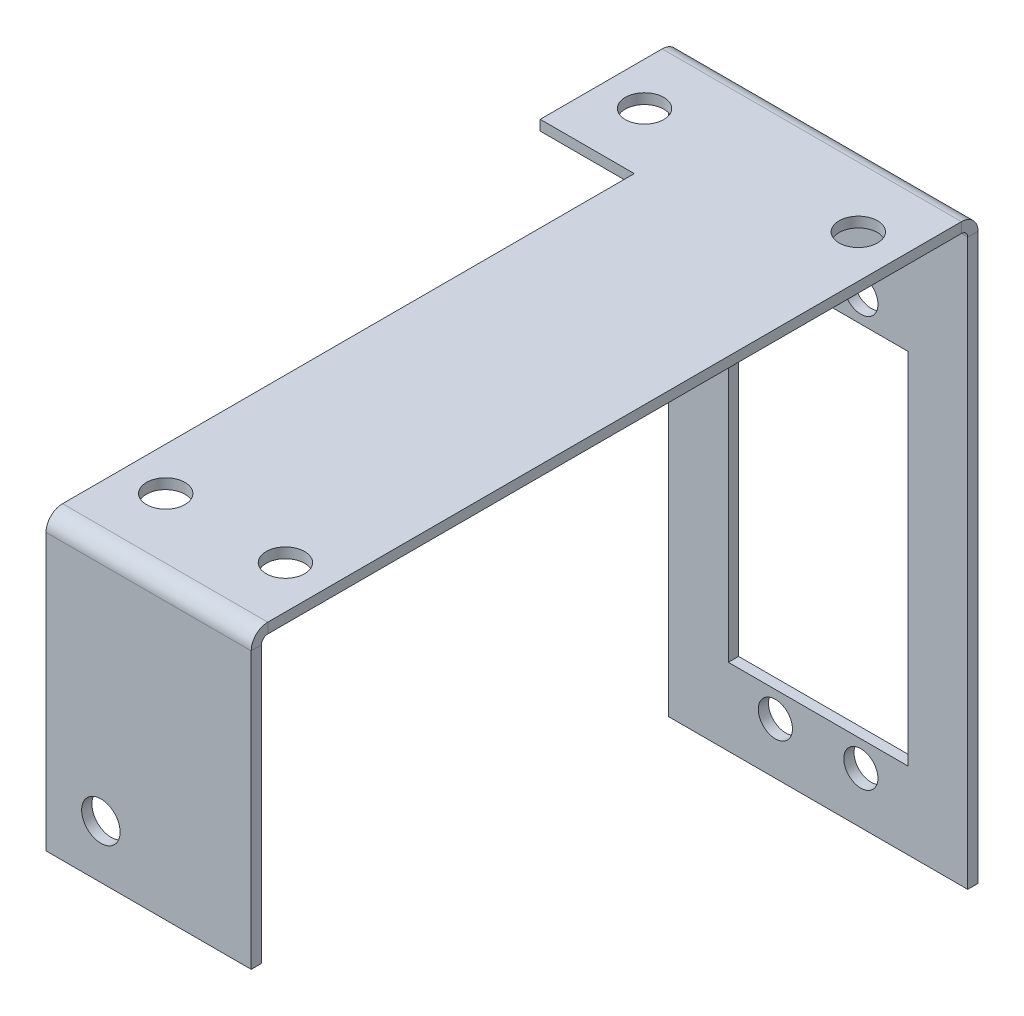
ISO-10303-21;
HEADER;
FILE_DESCRIPTION(('STEP AP214'),'2;1');
FILE_NAME('part.step','',(''),(''),'','','');
FILE_SCHEMA(('AUTOMOTIVE_DESIGN { 1 0 10303 214 1 1 1 1 }'));
ENDSEC;
DATA;
#1=APPLICATION_CONTEXT('core data for automotive mechanical design processes');
#2=APPLICATION_PROTOCOL_DEFINITION('international standard','automotive_design',2000,#1);
#3=PRODUCT_CONTEXT('',#1,'mechanical');
#4=PRODUCT('Part','Part','',(#3));
#5=PRODUCT_RELATED_PRODUCT_CATEGORY('part','',(#4));
#6=PRODUCT_DEFINITION_FORMATION('','',#4);
#7=PRODUCT_DEFINITION_CONTEXT('part definition',#1,'design');
#8=PRODUCT_DEFINITION('design','',#6,#7);
#9=PRODUCT_DEFINITION_SHAPE('','',#8);
#10=(LENGTH_UNIT() NAMED_UNIT(*) SI_UNIT(.MILLI.,.METRE.));
#11=(NAMED_UNIT(*) PLANE_ANGLE_UNIT() SI_UNIT($,.RADIAN.));
#12=(NAMED_UNIT(*) SI_UNIT($,.STERADIAN.) SOLID_ANGLE_UNIT());
#13=UNCERTAINTY_MEASURE_WITH_UNIT(LENGTH_MEASURE(1.E-05),#10,'distance_accuracy_value','');
#14=(GEOMETRIC_REPRESENTATION_CONTEXT(3) GLOBAL_UNCERTAINTY_ASSIGNED_CONTEXT((#13)) GLOBAL_UNIT_ASSIGNED_CONTEXT((#10,
#11,#12)) REPRESENTATION_CONTEXT('',''));
#15=CARTESIAN_POINT('',(0.,0.,0.));
#16=DIRECTION('',(0.,0.,1.));
#17=DIRECTION('',(1.,0.,0.));
#18=AXIS2_PLACEMENT_3D('',#15,#16,#17);
#19=CARTESIAN_POINT('',(28.,59.,0.));
#20=DIRECTION('',(-1.,0.,0.));
#21=DIRECTION('',(0.,-1.,0.));
#22=AXIS2_PLACEMENT_3D('',#19,#20,#21);
#23=PLANE('',#22);
#24=DIRECTION('',(0.,1.,0.));
#25=VECTOR('',#24,1.);
#26=CARTESIAN_POINT('',(28.,57.8000000000003,81.8634));
#27=LINE('',#26,#25);
#28=CARTESIAN_POINT('',(28.,57.8000000000003,81.8634));
#29=VERTEX_POINT('',#28);
#30=CARTESIAN_POINT('',(28.,59.0000000000003,81.8634));
#31=VERTEX_POINT('',#30);
#32=EDGE_CURVE('E111',#29,#31,#27,.T.);
#33=ORIENTED_EDGE('',*,*,#32,.F.);
#34=DIRECTION('',(0.,0.,1.));
#35=VECTOR('',#34,1.);
#36=CARTESIAN_POINT('',(28.,57.8,0.));
#37=LINE('',#36,#35);
#38=CARTESIAN_POINT('',(28.,57.8,0.736599999999997));
#39=VERTEX_POINT('',#38);
#40=EDGE_CURVE('E302',#29,#39,#37,.F.);
#41=ORIENTED_EDGE('',*,*,#40,.T.);
#42=DIRECTION('',(0.,-1.,0.));
#43=VECTOR('',#42,1.);
#44=CARTESIAN_POINT('',(28.,59.,0.736599999999993));
#45=LINE('',#44,#43);
#46=CARTESIAN_POINT('',(28.,59.,0.736599999999993));
#47=VERTEX_POINT('',#46);
#48=EDGE_CURVE('E278',#39,#47,#45,.F.);
#49=ORIENTED_EDGE('',*,*,#48,.T.);
#50=DIRECTION('',(0.,0.,-1.));
#51=VECTOR('',#50,1.);
#52=CARTESIAN_POINT('',(28.,59.,-2.09375685648164E-13));
#53=LINE('',#52,#51);
#54=EDGE_CURVE('E294',#31,#47,#53,.T.);
#55=ORIENTED_EDGE('',*,*,#54,.F.);
#56=EDGE_LOOP('',(#33,#41,#49,#55));
#57=FACE_BOUND('',#56,.T.);
#58=ADVANCED_FACE('F89',(#57),#23,.F.);
#59=CARTESIAN_POINT('',(0.,59.,-2.09375685648164E-13));
#60=DIRECTION('',(0.,-1.,0.));
#61=DIRECTION('',(0.,0.,-1.));
#62=AXIS2_PLACEMENT_3D('',#59,#60,#61);
#63=PLANE('',#62);
#64=CARTESIAN_POINT('',(-2.00000000000001,59.,7.79999999999998));
#65=DIRECTION('',(0.,1.,0.));
#66=DIRECTION('',(0.,0.,1.));
#67=AXIS2_PLACEMENT_3D('',#64,#65,#66);
#68=CIRCLE('',#67,2.25);
#69=CARTESIAN_POINT('',(-2.00000000000001,59.,10.05));
#70=VERTEX_POINT('',#69);
#71=EDGE_CURVE('E855',#70,#70,#68,.T.);
#72=ORIENTED_EDGE('',*,*,#71,.F.);
#73=EDGE_LOOP('',(#72));
#74=FACE_BOUND('',#73,.T.);
#75=CARTESIAN_POINT('',(8.99999999999999,59.0000000000003,74.8));
#76=DIRECTION('',(0.,1.,0.));
#77=DIRECTION('',(0.,0.,1.));
#78=AXIS2_PLACEMENT_3D('',#75,#76,#77);
#79=CIRCLE('',#78,2.25);
#80=CARTESIAN_POINT('',(8.99999999999999,59.0000000000003,77.05));
#81=VERTEX_POINT('',#80);
#82=EDGE_CURVE('E861',#81,#81,#79,.T.);
#83=ORIENTED_EDGE('',*,*,#82,.F.);
#84=EDGE_LOOP('',(#83));
#85=FACE_BOUND('',#84,.T.);
#86=CARTESIAN_POINT('',(23.,59.0000000000003,74.8));
#87=DIRECTION('',(0.,1.,0.));
#88=DIRECTION('',(0.,0.,1.));
#89=AXIS2_PLACEMENT_3D('',#86,#87,#88);
#90=CIRCLE('',#89,2.25);
#91=CARTESIAN_POINT('',(23.,59.0000000000003,77.05));
#92=VERTEX_POINT('',#91);
#93=EDGE_CURVE('E869',#92,#92,#90,.T.);
#94=ORIENTED_EDGE('',*,*,#93,.F.);
#95=EDGE_LOOP('',(#94));
#96=FACE_BOUND('',#95,.T.);
#97=CARTESIAN_POINT('',(23.,59.,7.79999999999998));
#98=DIRECTION('',(0.,1.,0.));
#99=DIRECTION('',(0.,0.,1.));
#100=AXIS2_PLACEMENT_3D('',#97,#98,#99);
#101=CIRCLE('',#100,2.25);
#102=CARTESIAN_POINT('',(23.,59.,10.05));
#103=VERTEX_POINT('',#102);
#104=EDGE_CURVE('E859',#103,#103,#101,.T.);
#105=ORIENTED_EDGE('',*,*,#104,.F.);
#106=EDGE_LOOP('',(#105));
#107=FACE_BOUND('',#106,.T.);
#108=DIRECTION('',(-1.,0.,0.));
#109=VECTOR('',#108,1.);
#110=CARTESIAN_POINT('',(3.99999999999999,59.0000000000003,81.8634));
#111=LINE('',#110,#109);
#112=CARTESIAN_POINT('',(3.99999999999999,59.0000000000003,81.8634));
#113=VERTEX_POINT('',#112);
#114=EDGE_CURVE('E104',#113,#31,#111,.F.);
#115=ORIENTED_EDGE('',*,*,#114,.T.);
#116=ORIENTED_EDGE('',*,*,#54,.T.);
#117=DIRECTION('',(-1.,0.,0.));
#118=VECTOR('',#117,1.);
#119=CARTESIAN_POINT('',(28.,59.,0.736599999999993));
#120=LINE('',#119,#118);
#121=CARTESIAN_POINT('',(-7.00000000000001,59.,0.736599999999993));
#122=VERTEX_POINT('',#121);
#123=EDGE_CURVE('E304',#122,#47,#120,.F.);
#124=ORIENTED_EDGE('',*,*,#123,.F.);
#125=DIRECTION('',(0.,0.,1.));
#126=VECTOR('',#125,1.);
#127=CARTESIAN_POINT('',(-7.00000000000001,59.,-2.08566148026042E-13));
#128=LINE('',#127,#126);
#129=CARTESIAN_POINT('',(-7.00000000000001,59.,15.));
#130=VERTEX_POINT('',#129);
#131=EDGE_CURVE('E292',#122,#130,#128,.T.);
#132=ORIENTED_EDGE('',*,*,#131,.T.);
#133=DIRECTION('',(1.,0.,0.));
#134=VECTOR('',#133,1.);
#135=CARTESIAN_POINT('',(0.,59.,15.));
#136=LINE('',#135,#134);
#137=CARTESIAN_POINT('',(3.99999999999999,59.,15.));
#138=VERTEX_POINT('',#137);
#139=EDGE_CURVE('E290',#130,#138,#136,.T.);
#140=ORIENTED_EDGE('',*,*,#139,.T.);
#141=DIRECTION('',(0.,0.,1.));
#142=VECTOR('',#141,1.);
#143=CARTESIAN_POINT('',(3.99999999999999,59.,-2.09325257640142E-13));
#144=LINE('',#143,#142);
#145=EDGE_CURVE('E288',#138,#113,#144,.T.);
#146=ORIENTED_EDGE('',*,*,#145,.T.);
#147=EDGE_LOOP('',(#115,#116,#124,#132,#140,#146));
#148=FACE_BOUND('',#147,.T.);
#149=ADVANCED_FACE('F450',(#74,#85,#96,#107,#148),#63,.F.);
#150=CARTESIAN_POINT('',(0.,57.8,-2.05185908041553E-13));
#151=DIRECTION('',(0.,-1.,0.));
#152=DIRECTION('',(0.,0.,-1.));
#153=AXIS2_PLACEMENT_3D('',#150,#151,#152);
#154=PLANE('',#153);
#155=CARTESIAN_POINT('',(-2.00000000000001,57.8,7.79999999999999));
#156=DIRECTION('',(0.,-1.,0.));
#157=DIRECTION('',(0.,0.,-1.));
#158=AXIS2_PLACEMENT_3D('',#155,#156,#157);
#159=CIRCLE('',#158,2.25);
#160=CARTESIAN_POINT('',(-2.00000000000001,57.8,5.54999999999999));
#161=VERTEX_POINT('',#160);
#162=EDGE_CURVE('E852',#161,#161,#159,.F.);
#163=ORIENTED_EDGE('',*,*,#162,.T.);
#164=EDGE_LOOP('',(#163));
#165=FACE_BOUND('',#164,.T.);
#166=CARTESIAN_POINT('',(8.99999999999999,57.8000000000003,74.8));
#167=DIRECTION('',(0.,-1.,0.));
#168=DIRECTION('',(0.,0.,-1.));
#169=AXIS2_PLACEMENT_3D('',#166,#167,#168);
#170=CIRCLE('',#169,2.25);
#171=CARTESIAN_POINT('',(8.99999999999999,57.8000000000003,72.55));
#172=VERTEX_POINT('',#171);
#173=EDGE_CURVE('E866',#172,#172,#170,.F.);
#174=ORIENTED_EDGE('',*,*,#173,.T.);
#175=EDGE_LOOP('',(#174));
#176=FACE_BOUND('',#175,.T.);
#177=CARTESIAN_POINT('',(23.,57.8000000000003,74.8));
#178=DIRECTION('',(0.,-1.,0.));
#179=DIRECTION('',(0.,0.,-1.));
#180=AXIS2_PLACEMENT_3D('',#177,#178,#179);
#181=CIRCLE('',#180,2.25);
#182=CARTESIAN_POINT('',(23.,57.8000000000003,72.55));
#183=VERTEX_POINT('',#182);
#184=EDGE_CURVE('E872',#183,#183,#181,.F.);
#185=ORIENTED_EDGE('',*,*,#184,.T.);
#186=EDGE_LOOP('',(#185));
#187=FACE_BOUND('',#186,.T.);
#188=CARTESIAN_POINT('',(23.,57.8,7.79999999999999));
#189=DIRECTION('',(0.,-1.,0.));
#190=DIRECTION('',(0.,0.,-1.));
#191=AXIS2_PLACEMENT_3D('',#188,#189,#190);
#192=CIRCLE('',#191,2.25);
#193=CARTESIAN_POINT('',(23.,57.8,5.54999999999999));
#194=VERTEX_POINT('',#193);
#195=EDGE_CURVE('E856',#194,#194,#192,.F.);
#196=ORIENTED_EDGE('',*,*,#195,.T.);
#197=EDGE_LOOP('',(#196));
#198=FACE_BOUND('',#197,.T.);
#199=ORIENTED_EDGE('',*,*,#40,.F.);
#200=DIRECTION('',(-1.,0.,0.));
#201=VECTOR('',#200,1.);
#202=CARTESIAN_POINT('',(3.99999999999999,57.8000000000003,81.8634));
#203=LINE('',#202,#201);
#204=CARTESIAN_POINT('',(3.99999999999999,57.8000000000003,81.8634));
#205=VERTEX_POINT('',#204);
#206=EDGE_CURVE('E273',#205,#29,#203,.F.);
#207=ORIENTED_EDGE('',*,*,#206,.F.);
#208=DIRECTION('',(0.,0.,-1.));
#209=VECTOR('',#208,1.);
#210=CARTESIAN_POINT('',(3.99999999999999,57.8,15.));
#211=LINE('',#210,#209);
#212=CARTESIAN_POINT('',(3.99999999999999,57.8,15.));
#213=VERTEX_POINT('',#212);
#214=EDGE_CURVE('E296',#213,#205,#211,.F.);
#215=ORIENTED_EDGE('',*,*,#214,.F.);
#216=DIRECTION('',(-1.,0.,0.));
#217=VECTOR('',#216,1.);
#218=CARTESIAN_POINT('',(-7.00000000000001,57.8,15.));
#219=LINE('',#218,#217);
#220=CARTESIAN_POINT('',(-7.00000000000001,57.8,15.));
#221=VERTEX_POINT('',#220);
#222=EDGE_CURVE('E298',#221,#213,#219,.F.);
#223=ORIENTED_EDGE('',*,*,#222,.F.);
#224=DIRECTION('',(0.,0.,-1.));
#225=VECTOR('',#224,1.);
#226=CARTESIAN_POINT('',(-7.00000000000001,57.8,15.));
#227=LINE('',#226,#225);
#228=CARTESIAN_POINT('',(-7.00000000000001,57.8,0.736599999999997));
#229=VERTEX_POINT('',#228);
#230=EDGE_CURVE('E300',#229,#221,#227,.F.);
#231=ORIENTED_EDGE('',*,*,#230,.F.);
#232=DIRECTION('',(-1.,0.,0.));
#233=VECTOR('',#232,1.);
#234=CARTESIAN_POINT('',(28.,57.8,0.736599999999997));
#235=LINE('',#234,#233);
#236=EDGE_CURVE('E310',#39,#229,#235,.T.);
#237=ORIENTED_EDGE('',*,*,#236,.F.);
#238=EDGE_LOOP('',(#199,#207,#215,#223,#231,#237));
#239=FACE_BOUND('',#238,.T.);
#240=ADVANCED_FACE('F445',(#165,#176,#187,#198,#239),#154,.T.);
#241=CARTESIAN_POINT('',(3.99999999999999,59.,15.));
#242=DIRECTION('',(1.,0.,0.));
#243=DIRECTION('',(0.,1.,0.));
#244=AXIS2_PLACEMENT_3D('',#241,#242,#243);
#245=PLANE('',#244);
#246=DIRECTION('',(0.,1.,0.));
#247=VECTOR('',#246,1.);
#248=CARTESIAN_POINT('',(3.99999999999999,57.8000000000003,81.8634));
#249=LINE('',#248,#247);
#250=EDGE_CURVE('E269',#205,#113,#249,.T.);
#251=ORIENTED_EDGE('',*,*,#250,.T.);
#252=ORIENTED_EDGE('',*,*,#145,.F.);
#253=DIRECTION('',(0.,1.,0.));
#254=VECTOR('',#253,1.);
#255=CARTESIAN_POINT('',(3.99999999999999,59.,15.));
#256=LINE('',#255,#254);
#257=EDGE_CURVE('E285',#138,#213,#256,.F.);
#258=ORIENTED_EDGE('',*,*,#257,.T.);
#259=ORIENTED_EDGE('',*,*,#214,.T.);
#260=EDGE_LOOP('',(#251,#252,#258,#259));
#261=FACE_BOUND('',#260,.T.);
#262=ADVANCED_FACE('F438',(#261),#245,.F.);
#263=CARTESIAN_POINT('',(-7.00000000000001,59.,-1.2));
#264=DIRECTION('',(-1.,0.,0.));
#265=DIRECTION('',(0.,-1.,0.));
#266=AXIS2_PLACEMENT_3D('',#263,#264,#265);
#267=PLANE('',#266);
#268=DIRECTION('',(0.,-1.,0.));
#269=VECTOR('',#268,1.);
#270=CARTESIAN_POINT('',(-7.00000000000001,59.,0.));
#271=LINE('',#270,#269);
#272=CARTESIAN_POINT('',(-7.00000000000001,57.0634,0.));
#273=VERTEX_POINT('',#272);
#274=CARTESIAN_POINT('',(-7.,-9.,0.));
#275=VERTEX_POINT('',#274);
#276=EDGE_CURVE('E404',#273,#275,#271,.T.);
#277=ORIENTED_EDGE('',*,*,#276,.F.);
#278=DIRECTION('',(0.,0.,-1.));
#279=VECTOR('',#278,1.);
#280=CARTESIAN_POINT('',(-7.00000000000001,57.0634,0.));
#281=LINE('',#280,#279);
#282=CARTESIAN_POINT('',(-7.00000000000001,57.0634,-1.2));
#283=VERTEX_POINT('',#282);
#284=EDGE_CURVE('E321',#273,#283,#281,.T.);
#285=ORIENTED_EDGE('',*,*,#284,.T.);
#286=DIRECTION('',(0.,-1.,0.));
#287=VECTOR('',#286,1.);
#288=CARTESIAN_POINT('',(-7.00000000000001,59.,-1.2));
#289=LINE('',#288,#287);
#290=CARTESIAN_POINT('',(-7.,-9.,-1.2));
#291=VERTEX_POINT('',#290);
#292=EDGE_CURVE('E396',#283,#291,#289,.T.);
#293=ORIENTED_EDGE('',*,*,#292,.T.);
#294=DIRECTION('',(0.,0.,1.));
#295=VECTOR('',#294,1.);
#296=CARTESIAN_POINT('',(-7.,-9.,-1.2));
#297=LINE('',#296,#295);
#298=EDGE_CURVE('E93',#291,#275,#297,.T.);
#299=ORIENTED_EDGE('',*,*,#298,.T.);
#300=EDGE_LOOP('',(#277,#285,#293,#299));
#301=FACE_BOUND('',#300,.T.);
#302=ADVANCED_FACE('F436',(#301),#267,.T.);
#303=CARTESIAN_POINT('',(0.,0.,-1.2));
#304=DIRECTION('',(0.,0.,-1.));
#305=DIRECTION('',(-1.,0.,0.));
#306=AXIS2_PLACEMENT_3D('',#303,#304,#305);
#307=PLANE('',#306);
#308=CARTESIAN_POINT('',(15.5,-3.,-1.2));
#309=DIRECTION('',(0.,0.,1.));
#310=DIRECTION('',(1.,0.,0.));
#311=AXIS2_PLACEMENT_3D('',#308,#309,#310);
#312=CIRCLE('',#311,2.);
#313=CARTESIAN_POINT('',(17.5,-3.,-1.2));
#314=VERTEX_POINT('',#313);
#315=EDGE_CURVE('E337',#314,#314,#312,.T.);
#316=ORIENTED_EDGE('',*,*,#315,.T.);
#317=EDGE_LOOP('',(#316));
#318=FACE_BOUND('',#317,.T.);
#319=CARTESIAN_POINT('',(5.49999999999999,45.,-1.2));
#320=DIRECTION('',(0.,0.,1.));
#321=DIRECTION('',(1.,0.,0.));
#322=AXIS2_PLACEMENT_3D('',#319,#320,#321);
#323=CIRCLE('',#322,2.);
#324=CARTESIAN_POINT('',(7.5,45.,-1.2));
#325=VERTEX_POINT('',#324);
#326=EDGE_CURVE('E343',#325,#325,#323,.T.);
#327=ORIENTED_EDGE('',*,*,#326,.T.);
#328=EDGE_LOOP('',(#327));
#329=FACE_BOUND('',#328,.T.);
#330=CARTESIAN_POINT('',(5.5,-3.,-1.2));
#331=DIRECTION('',(0.,0.,1.));
#332=DIRECTION('',(1.,0.,0.));
#333=AXIS2_PLACEMENT_3D('',#330,#331,#332);
#334=CIRCLE('',#333,2.);
#335=CARTESIAN_POINT('',(7.5,-3.,-1.2));
#336=VERTEX_POINT('',#335);
#337=EDGE_CURVE('E349',#336,#336,#334,.T.);
#338=ORIENTED_EDGE('',*,*,#337,.T.);
#339=EDGE_LOOP('',(#338));
#340=FACE_BOUND('',#339,.T.);
#341=CARTESIAN_POINT('',(15.5,45.,-1.2));
#342=DIRECTION('',(0.,0.,1.));
#343=DIRECTION('',(1.,0.,0.));
#344=AXIS2_PLACEMENT_3D('',#341,#342,#343);
#345=CIRCLE('',#344,2.);
#346=CARTESIAN_POINT('',(17.5,45.,-1.2));
#347=VERTEX_POINT('',#346);
#348=EDGE_CURVE('E355',#347,#347,#345,.T.);
#349=ORIENTED_EDGE('',*,*,#348,.T.);
#350=EDGE_LOOP('',(#349));
#351=FACE_BOUND('',#350,.T.);
#352=DIRECTION('',(0.,-1.,0.));
#353=VECTOR('',#352,1.);
#354=CARTESIAN_POINT('',(0.,0.,-1.2));
#355=LINE('',#354,#353);
#356=CARTESIAN_POINT('',(0.,42.,-1.2));
#357=VERTEX_POINT('',#356);
#358=CARTESIAN_POINT('',(0.,0.,-1.2));
#359=VERTEX_POINT('',#358);
#360=EDGE_CURVE('E361',#357,#359,#355,.T.);
#361=ORIENTED_EDGE('',*,*,#360,.T.);
#362=DIRECTION('',(1.,0.,0.));
#363=VECTOR('',#362,1.);
#364=CARTESIAN_POINT('',(0.,0.,-1.2));
#365=LINE('',#364,#363);
#366=CARTESIAN_POINT('',(21.,0.,-1.2));
#367=VERTEX_POINT('',#366);
#368=EDGE_CURVE('E364',#359,#367,#365,.T.);
#369=ORIENTED_EDGE('',*,*,#368,.T.);
#370=DIRECTION('',(0.,1.,0.));
#371=VECTOR('',#370,1.);
#372=CARTESIAN_POINT('',(21.,0.,-1.2));
#373=LINE('',#372,#371);
#374=CARTESIAN_POINT('',(21.,42.,-1.2));
#375=VERTEX_POINT('',#374);
#376=EDGE_CURVE('E368',#367,#375,#373,.T.);
#377=ORIENTED_EDGE('',*,*,#376,.T.);
#378=DIRECTION('',(-1.,0.,0.));
#379=VECTOR('',#378,1.);
#380=CARTESIAN_POINT('',(0.,42.,-1.2));
#381=LINE('',#380,#379);
#382=EDGE_CURVE('E371',#375,#357,#381,.T.);
#383=ORIENTED_EDGE('',*,*,#382,.T.);
#384=EDGE_LOOP('',(#361,#369,#377,#383));
#385=FACE_BOUND('',#384,.T.);
#386=ORIENTED_EDGE('',*,*,#292,.F.);
#387=DIRECTION('',(-1.,0.,0.));
#388=VECTOR('',#387,1.);
#389=CARTESIAN_POINT('',(-7.00000000000001,57.0634,-1.2));
#390=LINE('',#389,#388);
#391=CARTESIAN_POINT('',(28.,57.0634,-1.2));
#392=VERTEX_POINT('',#391);
#393=EDGE_CURVE('E314',#283,#392,#390,.F.);
#394=ORIENTED_EDGE('',*,*,#393,.T.);
#395=DIRECTION('',(0.,1.,0.));
#396=VECTOR('',#395,1.);
#397=CARTESIAN_POINT('',(28.,59.,-1.2));
#398=LINE('',#397,#396);
#399=CARTESIAN_POINT('',(28.,-9.,-1.2));
#400=VERTEX_POINT('',#399);
#401=EDGE_CURVE('E393',#400,#392,#398,.T.);
#402=ORIENTED_EDGE('',*,*,#401,.F.);
#403=DIRECTION('',(1.,0.,0.));
#404=VECTOR('',#403,1.);
#405=CARTESIAN_POINT('',(28.,-9.,-1.2));
#406=LINE('',#405,#404);
#407=EDGE_CURVE('E399',#291,#400,#406,.T.);
#408=ORIENTED_EDGE('',*,*,#407,.F.);
#409=EDGE_LOOP('',(#386,#394,#402,#408));
#410=FACE_BOUND('',#409,.T.);
#411=ADVANCED_FACE('F427',(#318,#329,#340,#351,#385,#410),#307,.T.);
#412=CARTESIAN_POINT('',(0.,0.,0.));
#413=DIRECTION('',(0.,0.,-1.));
#414=DIRECTION('',(-1.,0.,0.));
#415=AXIS2_PLACEMENT_3D('',#412,#413,#414);
#416=PLANE('',#415);
#417=DIRECTION('',(1.,0.,0.));
#418=VECTOR('',#417,1.);
#419=CARTESIAN_POINT('',(0.,0.,0.));
#420=LINE('',#419,#418);
#421=CARTESIAN_POINT('',(0.,0.,0.));
#422=VERTEX_POINT('',#421);
#423=CARTESIAN_POINT('',(21.,0.,0.));
#424=VERTEX_POINT('',#423);
#425=EDGE_CURVE('E376',#422,#424,#420,.T.);
#426=ORIENTED_EDGE('',*,*,#425,.F.);
#427=DIRECTION('',(0.,-1.,0.));
#428=VECTOR('',#427,1.);
#429=CARTESIAN_POINT('',(0.,0.,0.));
#430=LINE('',#429,#428);
#431=CARTESIAN_POINT('',(0.,42.,0.));
#432=VERTEX_POINT('',#431);
#433=EDGE_CURVE('E358',#432,#422,#430,.T.);
#434=ORIENTED_EDGE('',*,*,#433,.F.);
#435=DIRECTION('',(-1.,0.,0.));
#436=VECTOR('',#435,1.);
#437=CARTESIAN_POINT('',(0.,42.,0.));
#438=LINE('',#437,#436);
#439=CARTESIAN_POINT('',(21.,42.,0.));
#440=VERTEX_POINT('',#439);
#441=EDGE_CURVE('E365',#440,#432,#438,.T.);
#442=ORIENTED_EDGE('',*,*,#441,.F.);
#443=DIRECTION('',(0.,1.,0.));
#444=VECTOR('',#443,1.);
#445=CARTESIAN_POINT('',(21.,0.,0.));
#446=LINE('',#445,#444);
#447=EDGE_CURVE('E379',#424,#440,#446,.T.);
#448=ORIENTED_EDGE('',*,*,#447,.F.);
#449=EDGE_LOOP('',(#426,#434,#442,#448));
#450=FACE_BOUND('',#449,.T.);
#451=CARTESIAN_POINT('',(15.5,45.,0.));
#452=DIRECTION('',(0.,0.,1.));
#453=DIRECTION('',(1.,0.,0.));
#454=AXIS2_PLACEMENT_3D('',#451,#452,#453);
#455=CIRCLE('',#454,2.);
#456=CARTESIAN_POINT('',(17.5,45.,0.));
#457=VERTEX_POINT('',#456);
#458=EDGE_CURVE('E352',#457,#457,#455,.T.);
#459=ORIENTED_EDGE('',*,*,#458,.F.);
#460=EDGE_LOOP('',(#459));
#461=FACE_BOUND('',#460,.T.);
#462=CARTESIAN_POINT('',(5.5,-3.,0.));
#463=DIRECTION('',(0.,0.,1.));
#464=DIRECTION('',(1.,0.,0.));
#465=AXIS2_PLACEMENT_3D('',#462,#463,#464);
#466=CIRCLE('',#465,2.);
#467=CARTESIAN_POINT('',(7.5,-3.,0.));
#468=VERTEX_POINT('',#467);
#469=EDGE_CURVE('E346',#468,#468,#466,.T.);
#470=ORIENTED_EDGE('',*,*,#469,.F.);
#471=EDGE_LOOP('',(#470));
#472=FACE_BOUND('',#471,.T.);
#473=CARTESIAN_POINT('',(5.49999999999999,45.,0.));
#474=DIRECTION('',(0.,0.,1.));
#475=DIRECTION('',(1.,0.,0.));
#476=AXIS2_PLACEMENT_3D('',#473,#474,#475);
#477=CIRCLE('',#476,2.);
#478=CARTESIAN_POINT('',(7.5,45.,0.));
#479=VERTEX_POINT('',#478);
#480=EDGE_CURVE('E340',#479,#479,#477,.T.);
#481=ORIENTED_EDGE('',*,*,#480,.F.);
#482=EDGE_LOOP('',(#481));
#483=FACE_BOUND('',#482,.T.);
#484=CARTESIAN_POINT('',(15.5,-3.,0.));
#485=DIRECTION('',(0.,0.,1.));
#486=DIRECTION('',(1.,0.,0.));
#487=AXIS2_PLACEMENT_3D('',#484,#485,#486);
#488=CIRCLE('',#487,2.);
#489=CARTESIAN_POINT('',(17.5,-3.,0.));
#490=VERTEX_POINT('',#489);
#491=EDGE_CURVE('E334',#490,#490,#488,.T.);
#492=ORIENTED_EDGE('',*,*,#491,.F.);
#493=EDGE_LOOP('',(#492));
#494=FACE_BOUND('',#493,.T.);
#495=DIRECTION('',(-1.,0.,0.));
#496=VECTOR('',#495,1.);
#497=CARTESIAN_POINT('',(-7.00000000000001,57.0634,0.));
#498=LINE('',#497,#496);
#499=CARTESIAN_POINT('',(28.,57.0634,0.));
#500=VERTEX_POINT('',#499);
#501=EDGE_CURVE('E327',#273,#500,#498,.F.);
#502=ORIENTED_EDGE('',*,*,#501,.F.);
#503=ORIENTED_EDGE('',*,*,#276,.T.);
#504=DIRECTION('',(1.,0.,0.));
#505=VECTOR('',#504,1.);
#506=CARTESIAN_POINT('',(28.,-9.,0.));
#507=LINE('',#506,#505);
#508=CARTESIAN_POINT('',(28.,-9.,0.));
#509=VERTEX_POINT('',#508);
#510=EDGE_CURVE('E397',#275,#509,#507,.T.);
#511=ORIENTED_EDGE('',*,*,#510,.T.);
#512=DIRECTION('',(0.,1.,0.));
#513=VECTOR('',#512,1.);
#514=CARTESIAN_POINT('',(28.,59.,0.));
#515=LINE('',#514,#513);
#516=EDGE_CURVE('E386',#509,#500,#515,.T.);
#517=ORIENTED_EDGE('',*,*,#516,.T.);
#518=EDGE_LOOP('',(#502,#503,#511,#517));
#519=FACE_BOUND('',#518,.T.);
#520=ADVANCED_FACE('F410',(#450,#461,#472,#483,#494,#519),#416,.F.);
#521=CARTESIAN_POINT('',(28.,59.,-1.2));
#522=DIRECTION('',(1.,0.,0.));
#523=DIRECTION('',(0.,1.,0.));
#524=AXIS2_PLACEMENT_3D('',#521,#522,#523);
#525=PLANE('',#524);
#526=DIRECTION('',(0.,0.,-1.));
#527=VECTOR('',#526,1.);
#528=CARTESIAN_POINT('',(28.,57.0634,0.));
#529=LINE('',#528,#527);
#530=EDGE_CURVE('E331',#500,#392,#529,.T.);
#531=ORIENTED_EDGE('',*,*,#530,.F.);
#532=ORIENTED_EDGE('',*,*,#516,.F.);
#533=DIRECTION('',(0.,0.,1.));
#534=VECTOR('',#533,1.);
#535=CARTESIAN_POINT('',(28.,-9.,-1.2));
#536=LINE('',#535,#534);
#537=EDGE_CURVE('E13',#400,#509,#536,.T.);
#538=ORIENTED_EDGE('',*,*,#537,.F.);
#539=ORIENTED_EDGE('',*,*,#401,.T.);
#540=EDGE_LOOP('',(#531,#532,#538,#539));
#541=FACE_BOUND('',#540,.T.);
#542=ADVANCED_FACE('F91',(#541),#525,.T.);
#543=CARTESIAN_POINT('',(28.,-9.,-1.2));
#544=DIRECTION('',(0.,-1.,0.));
#545=DIRECTION('',(1.,0.,0.));
#546=AXIS2_PLACEMENT_3D('',#543,#544,#545);
#547=PLANE('',#546);
#548=ORIENTED_EDGE('',*,*,#510,.F.);
#549=ORIENTED_EDGE('',*,*,#298,.F.);
#550=ORIENTED_EDGE('',*,*,#407,.T.);
#551=ORIENTED_EDGE('',*,*,#537,.T.);
#552=EDGE_LOOP('',(#548,#549,#550,#551));
#553=FACE_BOUND('',#552,.T.);
#554=ADVANCED_FACE('F417',(#553),#547,.T.);
#555=CARTESIAN_POINT('',(0.,0.,-1.2));
#556=DIRECTION('',(-1.,0.,0.));
#557=DIRECTION('',(0.,0.,1.));
#558=AXIS2_PLACEMENT_3D('',#555,#556,#557);
#559=PLANE('',#558);
#560=ORIENTED_EDGE('',*,*,#433,.T.);
#561=DIRECTION('',(0.,0.,1.));
#562=VECTOR('',#561,1.);
#563=CARTESIAN_POINT('',(0.,0.,-1.2));
#564=LINE('',#563,#562);
#565=EDGE_CURVE('E374',#359,#422,#564,.T.);
#566=ORIENTED_EDGE('',*,*,#565,.F.);
#567=ORIENTED_EDGE('',*,*,#360,.F.);
#568=DIRECTION('',(0.,0.,1.));
#569=VECTOR('',#568,1.);
#570=CARTESIAN_POINT('',(0.,42.,-1.2));
#571=LINE('',#570,#569);
#572=EDGE_CURVE('E384',#357,#432,#571,.T.);
#573=ORIENTED_EDGE('',*,*,#572,.T.);
#574=EDGE_LOOP('',(#560,#566,#567,#573));
#575=FACE_BOUND('',#574,.T.);
#576=ADVANCED_FACE('F492',(#575),#559,.F.);
#577=CARTESIAN_POINT('',(0.,42.,-1.2));
#578=DIRECTION('',(0.,1.,0.));
#579=DIRECTION('',(0.,0.,1.));
#580=AXIS2_PLACEMENT_3D('',#577,#578,#579);
#581=PLANE('',#580);
#582=ORIENTED_EDGE('',*,*,#441,.T.);
#583=ORIENTED_EDGE('',*,*,#572,.F.);
#584=ORIENTED_EDGE('',*,*,#382,.F.);
#585=DIRECTION('',(0.,0.,1.));
#586=VECTOR('',#585,1.);
#587=CARTESIAN_POINT('',(21.,42.,-1.2));
#588=LINE('',#587,#586);
#589=EDGE_CURVE('E387',#375,#440,#588,.T.);
#590=ORIENTED_EDGE('',*,*,#589,.T.);
#591=EDGE_LOOP('',(#582,#583,#584,#590));
#592=FACE_BOUND('',#591,.T.);
#593=ADVANCED_FACE('F488',(#592),#581,.F.);
#594=CARTESIAN_POINT('',(21.,0.,-1.2));
#595=DIRECTION('',(1.,0.,0.));
#596=DIRECTION('',(0.,0.,-1.));
#597=AXIS2_PLACEMENT_3D('',#594,#595,#596);
#598=PLANE('',#597);
#599=ORIENTED_EDGE('',*,*,#447,.T.);
#600=ORIENTED_EDGE('',*,*,#589,.F.);
#601=ORIENTED_EDGE('',*,*,#376,.F.);
#602=DIRECTION('',(0.,0.,1.));
#603=VECTOR('',#602,1.);
#604=CARTESIAN_POINT('',(21.,0.,-1.2));
#605=LINE('',#604,#603);
#606=EDGE_CURVE('E389',#367,#424,#605,.T.);
#607=ORIENTED_EDGE('',*,*,#606,.T.);
#608=EDGE_LOOP('',(#599,#600,#601,#607));
#609=FACE_BOUND('',#608,.T.);
#610=ADVANCED_FACE('F491',(#609),#598,.F.);
#611=CARTESIAN_POINT('',(0.,0.,-1.2));
#612=DIRECTION('',(0.,-1.,0.));
#613=DIRECTION('',(0.,0.,-1.));
#614=AXIS2_PLACEMENT_3D('',#611,#612,#613);
#615=PLANE('',#614);
#616=ORIENTED_EDGE('',*,*,#425,.T.);
#617=ORIENTED_EDGE('',*,*,#606,.F.);
#618=ORIENTED_EDGE('',*,*,#368,.F.);
#619=ORIENTED_EDGE('',*,*,#565,.T.);
#620=EDGE_LOOP('',(#616,#617,#618,#619));
#621=FACE_BOUND('',#620,.T.);
#622=ADVANCED_FACE('F486',(#621),#615,.F.);
#623=CARTESIAN_POINT('',(15.5,45.,-1.2));
#624=DIRECTION('',(0.,0.,1.));
#625=DIRECTION('',(1.,0.,0.));
#626=AXIS2_PLACEMENT_3D('',#623,#624,#625);
#627=CYLINDRICAL_SURFACE('',#626,2.);
#628=ORIENTED_EDGE('',*,*,#348,.F.);
#629=EDGE_LOOP('',(#628));
#630=FACE_BOUND('',#629,.T.);
#631=ORIENTED_EDGE('',*,*,#458,.T.);
#632=EDGE_LOOP('',(#631));
#633=FACE_BOUND('',#632,.T.);
#634=ADVANCED_FACE('F482',(#630,#633),#627,.F.);
#635=CARTESIAN_POINT('',(5.5,-3.,-1.2));
#636=DIRECTION('',(0.,0.,1.));
#637=DIRECTION('',(1.,0.,0.));
#638=AXIS2_PLACEMENT_3D('',#635,#636,#637);
#639=CYLINDRICAL_SURFACE('',#638,2.);
#640=ORIENTED_EDGE('',*,*,#337,.F.);
#641=EDGE_LOOP('',(#640));
#642=FACE_BOUND('',#641,.T.);
#643=ORIENTED_EDGE('',*,*,#469,.T.);
#644=EDGE_LOOP('',(#643));
#645=FACE_BOUND('',#644,.T.);
#646=ADVANCED_FACE('F478',(#642,#645),#639,.F.);
#647=CARTESIAN_POINT('',(5.49999999999999,45.,-1.2));
#648=DIRECTION('',(0.,0.,1.));
#649=DIRECTION('',(1.,0.,0.));
#650=AXIS2_PLACEMENT_3D('',#647,#648,#649);
#651=CYLINDRICAL_SURFACE('',#650,2.);
#652=ORIENTED_EDGE('',*,*,#326,.F.);
#653=EDGE_LOOP('',(#652));
#654=FACE_BOUND('',#653,.T.);
#655=ORIENTED_EDGE('',*,*,#480,.T.);
#656=EDGE_LOOP('',(#655));
#657=FACE_BOUND('',#656,.T.);
#658=ADVANCED_FACE('F474',(#654,#657),#651,.F.);
#659=CARTESIAN_POINT('',(15.5,-3.,-1.2));
#660=DIRECTION('',(0.,0.,1.));
#661=DIRECTION('',(1.,0.,0.));
#662=AXIS2_PLACEMENT_3D('',#659,#660,#661);
#663=CYLINDRICAL_SURFACE('',#662,2.);
#664=ORIENTED_EDGE('',*,*,#315,.F.);
#665=EDGE_LOOP('',(#664));
#666=FACE_BOUND('',#665,.T.);
#667=ORIENTED_EDGE('',*,*,#491,.T.);
#668=EDGE_LOOP('',(#667));
#669=FACE_BOUND('',#668,.T.);
#670=ADVANCED_FACE('F469',(#666,#669),#663,.F.);
#671=CARTESIAN_POINT('',(28.,57.0634,0.7366));
#672=DIRECTION('',(1.,0.,0.));
#673=DIRECTION('',(0.,0.,-1.));
#674=AXIS2_PLACEMENT_3D('',#671,#672,#673);
#675=PLANE('',#674);
#676=ORIENTED_EDGE('',*,*,#48,.F.);
#677=CARTESIAN_POINT('',(28.,57.0634,0.7366));
#678=DIRECTION('',(-1.,0.,0.));
#679=DIRECTION('',(0.,0.,1.));
#680=AXIS2_PLACEMENT_3D('',#677,#678,#679);
#681=CIRCLE('',#680,0.736600000000004);
#682=EDGE_CURVE('E324',#500,#39,#681,.F.);
#683=ORIENTED_EDGE('',*,*,#682,.F.);
#684=ORIENTED_EDGE('',*,*,#530,.T.);
#685=CARTESIAN_POINT('',(28.,57.0634,0.7366));
#686=DIRECTION('',(-1.,0.,0.));
#687=DIRECTION('',(0.,0.,1.));
#688=AXIS2_PLACEMENT_3D('',#685,#686,#687);
#689=CIRCLE('',#688,1.9366);
#690=EDGE_CURVE('E317',#392,#47,#689,.F.);
#691=ORIENTED_EDGE('',*,*,#690,.T.);
#692=EDGE_LOOP('',(#676,#683,#684,#691));
#693=FACE_BOUND('',#692,.T.);
#694=ADVANCED_FACE('F424',(#693),#675,.T.);
#695=CARTESIAN_POINT('',(-7.00000000000001,57.0634,0.7366));
#696=DIRECTION('',(1.,0.,0.));
#697=DIRECTION('',(0.,0.,-1.));
#698=AXIS2_PLACEMENT_3D('',#695,#696,#697);
#699=PLANE('',#698);
#700=CARTESIAN_POINT('',(-7.00000000000001,57.0634,0.7366));
#701=DIRECTION('',(-1.,0.,0.));
#702=DIRECTION('',(0.,0.,1.));
#703=AXIS2_PLACEMENT_3D('',#700,#701,#702);
#704=CIRCLE('',#703,0.736600000000004);
#705=EDGE_CURVE('E284',#229,#273,#704,.T.);
#706=ORIENTED_EDGE('',*,*,#705,.F.);
#707=DIRECTION('',(0.,-1.,0.));
#708=VECTOR('',#707,1.);
#709=CARTESIAN_POINT('',(-7.00000000000001,57.8,0.736599999999997));
#710=LINE('',#709,#708);
#711=EDGE_CURVE('E307',#229,#122,#710,.F.);
#712=ORIENTED_EDGE('',*,*,#711,.T.);
#713=CARTESIAN_POINT('',(-7.00000000000001,57.0634,0.7366));
#714=DIRECTION('',(-1.,0.,0.));
#715=DIRECTION('',(0.,0.,1.));
#716=AXIS2_PLACEMENT_3D('',#713,#714,#715);
#717=CIRCLE('',#716,1.9366);
#718=EDGE_CURVE('E318',#122,#283,#717,.T.);
#719=ORIENTED_EDGE('',*,*,#718,.T.);
#720=ORIENTED_EDGE('',*,*,#284,.F.);
#721=EDGE_LOOP('',(#706,#712,#719,#720));
#722=FACE_BOUND('',#721,.T.);
#723=ADVANCED_FACE('F432',(#722),#699,.F.);
#724=CARTESIAN_POINT('',(-7.00000000000001,57.0634,0.7366));
#725=DIRECTION('',(-1.,0.,0.));
#726=DIRECTION('',(0.,1.,0.));
#727=AXIS2_PLACEMENT_3D('',#724,#725,#726);
#728=CYLINDRICAL_SURFACE('',#727,1.9366);
#729=ORIENTED_EDGE('',*,*,#393,.F.);
#730=ORIENTED_EDGE('',*,*,#718,.F.);
#731=ORIENTED_EDGE('',*,*,#123,.T.);
#732=ORIENTED_EDGE('',*,*,#690,.F.);
#733=EDGE_LOOP('',(#729,#730,#731,#732));
#734=FACE_BOUND('',#733,.T.);
#735=ADVANCED_FACE('F429',(#734),#728,.T.);
#736=CARTESIAN_POINT('',(-7.00000000000001,57.0634,0.7366));
#737=DIRECTION('',(-1.,0.,0.));
#738=DIRECTION('',(0.,1.,0.));
#739=AXIS2_PLACEMENT_3D('',#736,#737,#738);
#740=CYLINDRICAL_SURFACE('',#739,0.736600000000004);
#741=ORIENTED_EDGE('',*,*,#501,.T.);
#742=ORIENTED_EDGE('',*,*,#682,.T.);
#743=ORIENTED_EDGE('',*,*,#236,.T.);
#744=ORIENTED_EDGE('',*,*,#705,.T.);
#745=EDGE_LOOP('',(#741,#742,#743,#744));
#746=FACE_BOUND('',#745,.T.);
#747=ADVANCED_FACE('F463',(#746),#740,.F.);
#748=CARTESIAN_POINT('',(-7.00000000000001,59.,15.));
#749=DIRECTION('',(1.,0.,0.));
#750=DIRECTION('',(0.,1.,0.));
#751=AXIS2_PLACEMENT_3D('',#748,#749,#750);
#752=PLANE('',#751);
#753=ORIENTED_EDGE('',*,*,#711,.F.);
#754=ORIENTED_EDGE('',*,*,#230,.T.);
#755=DIRECTION('',(0.,-1.,0.));
#756=VECTOR('',#755,1.);
#757=CARTESIAN_POINT('',(-7.00000000000001,59.,15.));
#758=LINE('',#757,#756);
#759=EDGE_CURVE('E281',#130,#221,#758,.T.);
#760=ORIENTED_EDGE('',*,*,#759,.F.);
#761=ORIENTED_EDGE('',*,*,#131,.F.);
#762=EDGE_LOOP('',(#753,#754,#760,#761));
#763=FACE_BOUND('',#762,.T.);
#764=ADVANCED_FACE('F459',(#763),#752,.F.);
#765=CARTESIAN_POINT('',(-7.00000000000001,59.,15.));
#766=DIRECTION('',(0.,0.,-1.));
#767=DIRECTION('',(0.,1.,0.));
#768=AXIS2_PLACEMENT_3D('',#765,#766,#767);
#769=PLANE('',#768);
#770=ORIENTED_EDGE('',*,*,#222,.T.);
#771=ORIENTED_EDGE('',*,*,#257,.F.);
#772=ORIENTED_EDGE('',*,*,#139,.F.);
#773=ORIENTED_EDGE('',*,*,#759,.T.);
#774=EDGE_LOOP('',(#770,#771,#772,#773));
#775=FACE_BOUND('',#774,.T.);
#776=ADVANCED_FACE('F644',(#775),#769,.F.);
#777=CARTESIAN_POINT('',(28.,57.0634000000003,81.8634));
#778=DIRECTION('',(1.,0.,0.));
#779=DIRECTION('',(0.,0.,-1.));
#780=AXIS2_PLACEMENT_3D('',#777,#778,#779);
#781=PLANE('',#780);
#782=DIRECTION('',(0.,0.,1.));
#783=VECTOR('',#782,1.);
#784=CARTESIAN_POINT('',(28.,57.0634000000003,83.8000000000003));
#785=LINE('',#784,#783);
#786=CARTESIAN_POINT('',(28.,57.0634000000003,82.6));
#787=VERTEX_POINT('',#786);
#788=CARTESIAN_POINT('',(28.,57.0634000000003,83.8));
#789=VERTEX_POINT('',#788);
#790=EDGE_CURVE('E263',#787,#789,#785,.T.);
#791=ORIENTED_EDGE('',*,*,#790,.F.);
#792=CARTESIAN_POINT('',(28.,57.0634000000003,81.8634));
#793=DIRECTION('',(-1.,0.,0.));
#794=DIRECTION('',(0.,0.,1.));
#795=AXIS2_PLACEMENT_3D('',#792,#793,#794);
#796=CIRCLE('',#795,0.736600000000004);
#797=EDGE_CURVE('E221',#29,#787,#796,.F.);
#798=ORIENTED_EDGE('',*,*,#797,.F.);
#799=ORIENTED_EDGE('',*,*,#32,.T.);
#800=CARTESIAN_POINT('',(28.,57.0634000000003,81.8634));
#801=DIRECTION('',(-1.,0.,0.));
#802=DIRECTION('',(0.,0.,1.));
#803=AXIS2_PLACEMENT_3D('',#800,#801,#802);
#804=CIRCLE('',#803,1.9366);
#805=EDGE_CURVE('E268',#31,#789,#804,.F.);
#806=ORIENTED_EDGE('',*,*,#805,.T.);
#807=EDGE_LOOP('',(#791,#798,#799,#806));
#808=FACE_BOUND('',#807,.T.);
#809=ADVANCED_FACE('F654',(#808),#781,.T.);
#810=CARTESIAN_POINT('',(3.99999999999999,57.0634000000003,81.8634));
#811=DIRECTION('',(1.,0.,0.));
#812=DIRECTION('',(0.,0.,-1.));
#813=AXIS2_PLACEMENT_3D('',#810,#811,#812);
#814=PLANE('',#813);
#815=CARTESIAN_POINT('',(3.99999999999999,57.0634000000003,81.8634));
#816=DIRECTION('',(-1.,0.,0.));
#817=DIRECTION('',(0.,0.,1.));
#818=AXIS2_PLACEMENT_3D('',#815,#816,#817);
#819=CIRCLE('',#818,0.736600000000004);
#820=CARTESIAN_POINT('',(3.99999999999999,57.0634000000003,82.6));
#821=VERTEX_POINT('',#820);
#822=EDGE_CURVE('E228',#821,#205,#819,.T.);
#823=ORIENTED_EDGE('',*,*,#822,.F.);
#824=DIRECTION('',(0.,0.,1.));
#825=VECTOR('',#824,1.);
#826=CARTESIAN_POINT('',(3.99999999999999,57.0634000000003,82.6));
#827=LINE('',#826,#825);
#828=CARTESIAN_POINT('',(3.99999999999999,57.0634000000003,83.8));
#829=VERTEX_POINT('',#828);
#830=EDGE_CURVE('E225',#821,#829,#827,.T.);
#831=ORIENTED_EDGE('',*,*,#830,.T.);
#832=CARTESIAN_POINT('',(3.99999999999999,57.0634000000003,81.8634));
#833=DIRECTION('',(-1.,0.,0.));
#834=DIRECTION('',(0.,0.,1.));
#835=AXIS2_PLACEMENT_3D('',#832,#833,#834);
#836=CIRCLE('',#835,1.9366);
#837=EDGE_CURVE('E212',#829,#113,#836,.T.);
#838=ORIENTED_EDGE('',*,*,#837,.T.);
#839=ORIENTED_EDGE('',*,*,#250,.F.);
#840=EDGE_LOOP('',(#823,#831,#838,#839));
#841=FACE_BOUND('',#840,.T.);
#842=ADVANCED_FACE('F226',(#841),#814,.F.);
#843=CARTESIAN_POINT('',(3.99999999999999,57.0634000000003,81.8634));
#844=DIRECTION('',(-1.,0.,0.));
#845=DIRECTION('',(0.,0.,1.));
#846=AXIS2_PLACEMENT_3D('',#843,#844,#845);
#847=CYLINDRICAL_SURFACE('',#846,1.9366);
#848=ORIENTED_EDGE('',*,*,#114,.F.);
#849=ORIENTED_EDGE('',*,*,#837,.F.);
#850=DIRECTION('',(-1.,0.,0.));
#851=VECTOR('',#850,1.);
#852=CARTESIAN_POINT('',(0.,57.0634000000003,83.8));
#853=LINE('',#852,#851);
#854=EDGE_CURVE('E217',#789,#829,#853,.T.);
#855=ORIENTED_EDGE('',*,*,#854,.F.);
#856=ORIENTED_EDGE('',*,*,#805,.F.);
#857=EDGE_LOOP('',(#848,#849,#855,#856));
#858=FACE_BOUND('',#857,.T.);
#859=ADVANCED_FACE('F214',(#858),#847,.T.);
#860=CARTESIAN_POINT('',(3.99999999999999,57.0634000000003,81.8634));
#861=DIRECTION('',(-1.,0.,0.));
#862=DIRECTION('',(0.,0.,1.));
#863=AXIS2_PLACEMENT_3D('',#860,#861,#862);
#864=CYLINDRICAL_SURFACE('',#863,0.736600000000004);
#865=ORIENTED_EDGE('',*,*,#206,.T.);
#866=ORIENTED_EDGE('',*,*,#797,.T.);
#867=DIRECTION('',(1.,0.,0.));
#868=VECTOR('',#867,1.);
#869=CARTESIAN_POINT('',(28.,57.0634000000003,82.6));
#870=LINE('',#869,#868);
#871=EDGE_CURVE('E233',#787,#821,#870,.F.);
#872=ORIENTED_EDGE('',*,*,#871,.T.);
#873=ORIENTED_EDGE('',*,*,#822,.T.);
#874=EDGE_LOOP('',(#865,#866,#872,#873));
#875=FACE_BOUND('',#874,.T.);
#876=ADVANCED_FACE('F709',(#875),#864,.F.);
#877=CARTESIAN_POINT('',(3.99999999999999,57.8000000000003,83.8));
#878=DIRECTION('',(-1.,0.,0.));
#879=DIRECTION('',(0.,-1.,0.));
#880=AXIS2_PLACEMENT_3D('',#877,#878,#879);
#881=PLANE('',#880);
#882=DIRECTION('',(0.,1.,0.));
#883=VECTOR('',#882,1.);
#884=CARTESIAN_POINT('',(3.99999999999999,57.8000000000003,83.8));
#885=LINE('',#884,#883);
#886=CARTESIAN_POINT('',(4.,24.8000000000003,83.8000000000003));
#887=VERTEX_POINT('',#886);
#888=EDGE_CURVE('E240',#887,#829,#885,.T.);
#889=ORIENTED_EDGE('',*,*,#888,.T.);
#890=ORIENTED_EDGE('',*,*,#830,.F.);
#891=DIRECTION('',(0.,-1.,0.));
#892=VECTOR('',#891,1.);
#893=CARTESIAN_POINT('',(4.00000000000001,5.96083103884496E-13,82.6000000000004));
#894=LINE('',#893,#892);
#895=CARTESIAN_POINT('',(4.,24.8000000000003,82.6000000000002));
#896=VERTEX_POINT('',#895);
#897=EDGE_CURVE('E256',#896,#821,#894,.F.);
#898=ORIENTED_EDGE('',*,*,#897,.F.);
#899=DIRECTION('',(0.,0.,-1.));
#900=VECTOR('',#899,1.);
#901=CARTESIAN_POINT('',(4.,24.8000000000003,83.8000000000003));
#902=LINE('',#901,#900);
#903=EDGE_CURVE('E245',#887,#896,#902,.T.);
#904=ORIENTED_EDGE('',*,*,#903,.F.);
#905=EDGE_LOOP('',(#889,#890,#898,#904));
#906=FACE_BOUND('',#905,.T.);
#907=ADVANCED_FACE('F244',(#906),#881,.T.);
#908=CARTESIAN_POINT('',(28.,24.8000000000003,83.8000000000003));
#909=DIRECTION('',(1.,0.,0.));
#910=DIRECTION('',(0.,1.,0.));
#911=AXIS2_PLACEMENT_3D('',#908,#909,#910);
#912=PLANE('',#911);
#913=DIRECTION('',(0.,1.,0.));
#914=VECTOR('',#913,1.);
#915=CARTESIAN_POINT('',(28.,6.00814167909888E-13,82.6000000000004));
#916=LINE('',#915,#914);
#917=CARTESIAN_POINT('',(28.,24.8000000000003,82.6000000000002));
#918=VERTEX_POINT('',#917);
#919=EDGE_CURVE('E242',#787,#918,#916,.F.);
#920=ORIENTED_EDGE('',*,*,#919,.F.);
#921=ORIENTED_EDGE('',*,*,#790,.T.);
#922=DIRECTION('',(0.,-1.,0.));
#923=VECTOR('',#922,1.);
#924=CARTESIAN_POINT('',(28.,24.8000000000003,83.8000000000003));
#925=LINE('',#924,#923);
#926=CARTESIAN_POINT('',(28.,24.8000000000003,83.8000000000003));
#927=VERTEX_POINT('',#926);
#928=EDGE_CURVE('E241',#789,#927,#925,.T.);
#929=ORIENTED_EDGE('',*,*,#928,.T.);
#930=DIRECTION('',(0.,0.,-1.));
#931=VECTOR('',#930,1.);
#932=CARTESIAN_POINT('',(28.,24.8000000000003,83.8000000000003));
#933=LINE('',#932,#931);
#934=EDGE_CURVE('E247',#927,#918,#933,.T.);
#935=ORIENTED_EDGE('',*,*,#934,.T.);
#936=EDGE_LOOP('',(#920,#921,#929,#935));
#937=FACE_BOUND('',#936,.T.);
#938=ADVANCED_FACE('F729',(#937),#912,.T.);
#939=CARTESIAN_POINT('',(0.,6.0328967187972E-13,83.8000000000004));
#940=DIRECTION('',(0.,0.,1.));
#941=DIRECTION('',(0.,-1.,0.));
#942=AXIS2_PLACEMENT_3D('',#939,#940,#941);
#943=PLANE('',#942);
#944=CARTESIAN_POINT('',(10.419999997432,31.0300000000003,83.8000000000004));
#945=DIRECTION('',(0.,0.,1.));
#946=DIRECTION('',(1.,0.,0.));
#947=AXIS2_PLACEMENT_3D('',#944,#945,#946);
#948=CIRCLE('',#947,2.25);
#949=CARTESIAN_POINT('',(12.669999997432,31.0300000000003,83.8000000000004));
#950=VERTEX_POINT('',#949);
#951=EDGE_CURVE('E876',#950,#950,#948,.T.);
#952=ORIENTED_EDGE('',*,*,#951,.F.);
#953=EDGE_LOOP('',(#952));
#954=FACE_BOUND('',#953,.T.);
#955=ORIENTED_EDGE('',*,*,#928,.F.);
#956=ORIENTED_EDGE('',*,*,#854,.T.);
#957=ORIENTED_EDGE('',*,*,#888,.F.);
#958=DIRECTION('',(-1.,0.,0.));
#959=VECTOR('',#958,1.);
#960=CARTESIAN_POINT('',(4.,24.8000000000003,83.8000000000003));
#961=LINE('',#960,#959);
#962=EDGE_CURVE('E248',#927,#887,#961,.T.);
#963=ORIENTED_EDGE('',*,*,#962,.F.);
#964=EDGE_LOOP('',(#955,#956,#957,#963));
#965=FACE_BOUND('',#964,.T.);
#966=ADVANCED_FACE('F238',(#954,#965),#943,.T.);
#967=CARTESIAN_POINT('',(0.,5.94926621567178E-13,82.6000000000004));
#968=DIRECTION('',(0.,0.,1.));
#969=DIRECTION('',(0.,-1.,0.));
#970=AXIS2_PLACEMENT_3D('',#967,#968,#969);
#971=PLANE('',#970);
#972=CARTESIAN_POINT('',(10.419999997432,31.0300000000003,82.6000000000002));
#973=DIRECTION('',(0.,0.,1.));
#974=DIRECTION('',(0.,-1.,0.));
#975=AXIS2_PLACEMENT_3D('',#972,#973,#974);
#976=CIRCLE('',#975,2.25);
#977=CARTESIAN_POINT('',(10.419999997432,28.7800000000003,82.6000000000002));
#978=VERTEX_POINT('',#977);
#979=EDGE_CURVE('E266',#978,#978,#976,.F.);
#980=ORIENTED_EDGE('',*,*,#979,.F.);
#981=EDGE_LOOP('',(#980));
#982=FACE_BOUND('',#981,.T.);
#983=ORIENTED_EDGE('',*,*,#871,.F.);
#984=ORIENTED_EDGE('',*,*,#919,.T.);
#985=DIRECTION('',(1.,0.,0.));
#986=VECTOR('',#985,1.);
#987=CARTESIAN_POINT('',(0.,24.8000000000003,82.6000000000002));
#988=LINE('',#987,#986);
#989=EDGE_CURVE('E258',#918,#896,#988,.F.);
#990=ORIENTED_EDGE('',*,*,#989,.T.);
#991=ORIENTED_EDGE('',*,*,#897,.T.);
#992=EDGE_LOOP('',(#983,#984,#990,#991));
#993=FACE_BOUND('',#992,.T.);
#994=ADVANCED_FACE('F750',(#982,#993),#971,.F.);
#995=CARTESIAN_POINT('',(4.,24.8000000000003,83.8000000000003));
#996=DIRECTION('',(0.,-1.,0.));
#997=DIRECTION('',(0.,0.,-1.));
#998=AXIS2_PLACEMENT_3D('',#995,#996,#997);
#999=PLANE('',#998);
#1000=ORIENTED_EDGE('',*,*,#989,.F.);
#1001=ORIENTED_EDGE('',*,*,#934,.F.);
#1002=ORIENTED_EDGE('',*,*,#962,.T.);
#1003=ORIENTED_EDGE('',*,*,#903,.T.);
#1004=EDGE_LOOP('',(#1000,#1001,#1002,#1003));
#1005=FACE_BOUND('',#1004,.T.);
#1006=ADVANCED_FACE('F761',(#1005),#999,.T.);
#1007=CARTESIAN_POINT('',(10.419999997432,31.0300000000003,-1.20100000000001));
#1008=DIRECTION('',(0.,0.,1.));
#1009=DIRECTION('',(1.,0.,0.));
#1010=AXIS2_PLACEMENT_3D('',#1007,#1008,#1009);
#1011=CYLINDRICAL_SURFACE('',#1010,2.25);
#1012=ORIENTED_EDGE('',*,*,#951,.T.);
#1013=EDGE_LOOP('',(#1012));
#1014=FACE_BOUND('',#1013,.T.);
#1015=ORIENTED_EDGE('',*,*,#979,.T.);
#1016=EDGE_LOOP('',(#1015));
#1017=FACE_BOUND('',#1016,.T.);
#1018=ADVANCED_FACE('F772',(#1014,#1017),#1011,.F.);
#1019=CARTESIAN_POINT('',(23.,-9.00100000000026,7.80000000000022));
#1020=DIRECTION('',(0.,1.,0.));
#1021=DIRECTION('',(0.,0.,1.));
#1022=AXIS2_PLACEMENT_3D('',#1019,#1020,#1021);
#1023=CYLINDRICAL_SURFACE('',#1022,2.25);
#1024=ORIENTED_EDGE('',*,*,#195,.F.);
#1025=EDGE_LOOP('',(#1024));
#1026=FACE_BOUND('',#1025,.T.);
#1027=ORIENTED_EDGE('',*,*,#104,.T.);
#1028=EDGE_LOOP('',(#1027));
#1029=FACE_BOUND('',#1028,.T.);
#1030=ADVANCED_FACE('F782',(#1026,#1029),#1023,.F.);
#1031=CARTESIAN_POINT('',(23.,-9.00100000000003,74.8000000000002));
#1032=DIRECTION('',(0.,1.,0.));
#1033=DIRECTION('',(0.,0.,1.));
#1034=AXIS2_PLACEMENT_3D('',#1031,#1032,#1033);
#1035=CYLINDRICAL_SURFACE('',#1034,2.25);
#1036=ORIENTED_EDGE('',*,*,#184,.F.);
#1037=EDGE_LOOP('',(#1036));
#1038=FACE_BOUND('',#1037,.T.);
#1039=ORIENTED_EDGE('',*,*,#93,.T.);
#1040=EDGE_LOOP('',(#1039));
#1041=FACE_BOUND('',#1040,.T.);
#1042=ADVANCED_FACE('F793',(#1038,#1041),#1035,.F.);
#1043=CARTESIAN_POINT('',(9.00000000000001,-9.00100000000003,74.8000000000002));
#1044=DIRECTION('',(0.,1.,0.));
#1045=DIRECTION('',(0.,0.,1.));
#1046=AXIS2_PLACEMENT_3D('',#1043,#1044,#1045);
#1047=CYLINDRICAL_SURFACE('',#1046,2.25);
#1048=ORIENTED_EDGE('',*,*,#173,.F.);
#1049=EDGE_LOOP('',(#1048));
#1050=FACE_BOUND('',#1049,.T.);
#1051=ORIENTED_EDGE('',*,*,#82,.T.);
#1052=EDGE_LOOP('',(#1051));
#1053=FACE_BOUND('',#1052,.T.);
#1054=ADVANCED_FACE('F804',(#1050,#1053),#1047,.F.);
#1055=CARTESIAN_POINT('',(-1.99999999999999,-9.00100000000027,7.80000000000022));
#1056=DIRECTION('',(0.,1.,0.));
#1057=DIRECTION('',(0.,0.,1.));
#1058=AXIS2_PLACEMENT_3D('',#1055,#1056,#1057);
#1059=CYLINDRICAL_SURFACE('',#1058,2.25);
#1060=ORIENTED_EDGE('',*,*,#162,.F.);
#1061=EDGE_LOOP('',(#1060));
#1062=FACE_BOUND('',#1061,.T.);
#1063=ORIENTED_EDGE('',*,*,#71,.T.);
#1064=EDGE_LOOP('',(#1063));
#1065=FACE_BOUND('',#1064,.T.);
#1066=ADVANCED_FACE('F815',(#1062,#1065),#1059,.F.);
#1067=CLOSED_SHELL('',(#58,#149,#240,#262,#302,#411,#520,#542,#554,#576,#593,#610,#622,#634,
#646,#658,#670,#694,#723,#735,#747,#764,#776,#809,#842,#859,#876,#907,#938,#966,#994,#1006,
#1018,#1030,#1042,#1054,#1066));
#1068=MANIFOLD_SOLID_BREP('B2',#1067);
#1069=ADVANCED_BREP_SHAPE_REPRESENTATION('',(#18,#1068),#14);
#1070=SHAPE_DEFINITION_REPRESENTATION(#9,#1069);
ENDSEC;
END-ISO-10303-21;
